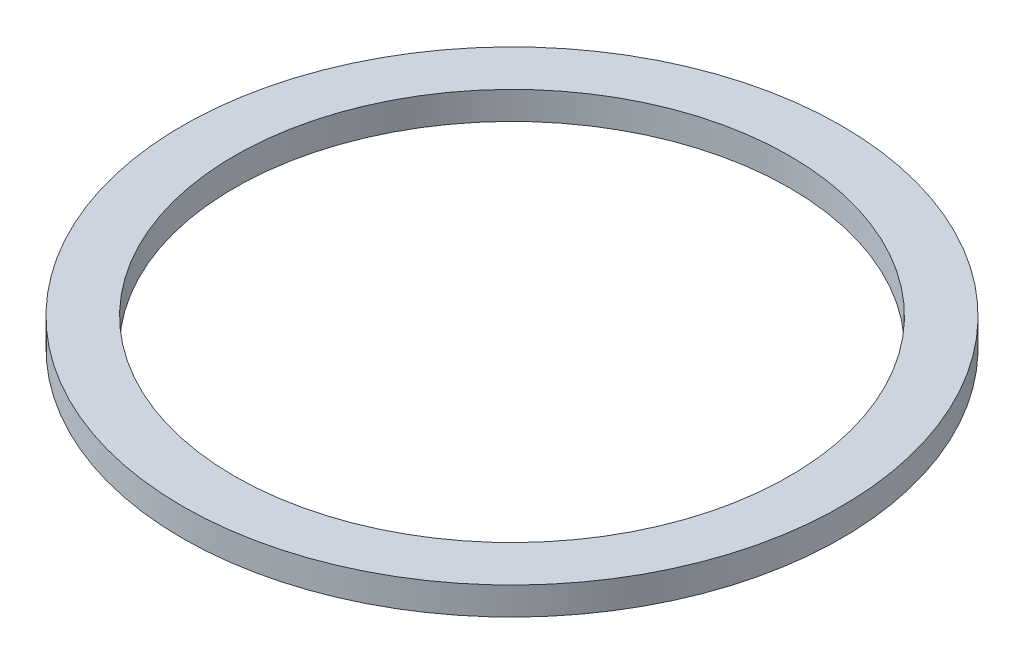
ISO-10303-21;
HEADER;
FILE_DESCRIPTION(('STEP AP214'),'2;1');
FILE_NAME('part.step','',(''),(''),'','','');
FILE_SCHEMA(('AUTOMOTIVE_DESIGN { 1 0 10303 214 1 1 1 1 }'));
ENDSEC;
DATA;
#1=APPLICATION_CONTEXT('core data for automotive mechanical design processes');
#2=APPLICATION_PROTOCOL_DEFINITION('international standard','automotive_design',2000,#1);
#3=PRODUCT_CONTEXT('',#1,'mechanical');
#4=PRODUCT('Part','Part','',(#3));
#5=PRODUCT_RELATED_PRODUCT_CATEGORY('part','',(#4));
#6=PRODUCT_DEFINITION_FORMATION('','',#4);
#7=PRODUCT_DEFINITION_CONTEXT('part definition',#1,'design');
#8=PRODUCT_DEFINITION('design','',#6,#7);
#9=PRODUCT_DEFINITION_SHAPE('','',#8);
#10=(LENGTH_UNIT() NAMED_UNIT(*) SI_UNIT(.MILLI.,.METRE.));
#11=(NAMED_UNIT(*) PLANE_ANGLE_UNIT() SI_UNIT($,.RADIAN.));
#12=(NAMED_UNIT(*) SI_UNIT($,.STERADIAN.) SOLID_ANGLE_UNIT());
#13=UNCERTAINTY_MEASURE_WITH_UNIT(LENGTH_MEASURE(1.E-05),#10,'distance_accuracy_value','');
#14=(GEOMETRIC_REPRESENTATION_CONTEXT(3) GLOBAL_UNCERTAINTY_ASSIGNED_CONTEXT((#13)) GLOBAL_UNIT_ASSIGNED_CONTEXT((#10,
#11,#12)) REPRESENTATION_CONTEXT('',''));
#15=CARTESIAN_POINT('',(0.,0.,0.));
#16=DIRECTION('',(0.,0.,1.));
#17=DIRECTION('',(1.,0.,0.));
#18=AXIS2_PLACEMENT_3D('',#15,#16,#17);
#19=CARTESIAN_POINT('',(0.,4.,0.));
#20=DIRECTION('',(0.,-1.,0.));
#21=DIRECTION('',(0.,0.,-1.));
#22=AXIS2_PLACEMENT_3D('',#19,#20,#21);
#23=CYLINDRICAL_SURFACE('',#22,47.5);
#24=CARTESIAN_POINT('',(0.,4.,0.));
#25=DIRECTION('',(0.,1.,0.));
#26=DIRECTION('',(0.,0.,1.));
#27=AXIS2_PLACEMENT_3D('',#24,#25,#26);
#28=CIRCLE('',#27,47.5);
#29=CARTESIAN_POINT('',(0.,4.,47.5));
#30=VERTEX_POINT('',#29);
#31=EDGE_CURVE('E10',#30,#30,#28,.T.);
#32=ORIENTED_EDGE('',*,*,#31,.F.);
#33=EDGE_LOOP('',(#32));
#34=FACE_BOUND('',#33,.T.);
#35=CARTESIAN_POINT('',(0.,0.,0.));
#36=DIRECTION('',(0.,1.,0.));
#37=DIRECTION('',(0.,0.,1.));
#38=AXIS2_PLACEMENT_3D('',#35,#36,#37);
#39=CIRCLE('',#38,47.5);
#40=CARTESIAN_POINT('',(0.,0.,47.5));
#41=VERTEX_POINT('',#40);
#42=EDGE_CURVE('E37',#41,#41,#39,.T.);
#43=ORIENTED_EDGE('',*,*,#42,.T.);
#44=EDGE_LOOP('',(#43));
#45=FACE_BOUND('',#44,.T.);
#46=ADVANCED_FACE('F40',(#34,#45),#23,.T.);
#47=CARTESIAN_POINT('',(0.,4.,0.));
#48=DIRECTION('',(0.,1.,0.));
#49=DIRECTION('',(0.,0.,1.));
#50=AXIS2_PLACEMENT_3D('',#47,#48,#49);
#51=PLANE('',#50);
#52=CARTESIAN_POINT('',(0.,4.,0.));
#53=DIRECTION('',(0.,1.,0.));
#54=DIRECTION('',(0.,0.,1.));
#55=AXIS2_PLACEMENT_3D('',#52,#53,#54);
#56=CIRCLE('',#55,40.);
#57=CARTESIAN_POINT('',(0.,4.,40.));
#58=VERTEX_POINT('',#57);
#59=EDGE_CURVE('E50',#58,#58,#56,.T.);
#60=ORIENTED_EDGE('',*,*,#59,.F.);
#61=EDGE_LOOP('',(#60));
#62=FACE_BOUND('',#61,.T.);
#63=ORIENTED_EDGE('',*,*,#31,.T.);
#64=EDGE_LOOP('',(#63));
#65=FACE_BOUND('',#64,.T.);
#66=ADVANCED_FACE('F59',(#62,#65),#51,.T.);
#67=CARTESIAN_POINT('',(0.,0.,0.));
#68=DIRECTION('',(0.,1.,0.));
#69=DIRECTION('',(0.,0.,1.));
#70=AXIS2_PLACEMENT_3D('',#67,#68,#69);
#71=PLANE('',#70);
#72=CARTESIAN_POINT('',(0.,0.,0.));
#73=DIRECTION('',(0.,1.,0.));
#74=DIRECTION('',(0.,0.,1.));
#75=AXIS2_PLACEMENT_3D('',#72,#73,#74);
#76=CIRCLE('',#75,40.);
#77=CARTESIAN_POINT('',(0.,0.,40.));
#78=VERTEX_POINT('',#77);
#79=EDGE_CURVE('E47',#78,#78,#76,.T.);
#80=ORIENTED_EDGE('',*,*,#79,.T.);
#81=EDGE_LOOP('',(#80));
#82=FACE_BOUND('',#81,.T.);
#83=ORIENTED_EDGE('',*,*,#42,.F.);
#84=EDGE_LOOP('',(#83));
#85=FACE_BOUND('',#84,.T.);
#86=ADVANCED_FACE('F58',(#82,#85),#71,.F.);
#87=CARTESIAN_POINT('',(0.,4.,0.));
#88=DIRECTION('',(0.,-1.,0.));
#89=DIRECTION('',(0.,0.,-1.));
#90=AXIS2_PLACEMENT_3D('',#87,#88,#89);
#91=CYLINDRICAL_SURFACE('',#90,40.);
#92=ORIENTED_EDGE('',*,*,#59,.T.);
#93=EDGE_LOOP('',(#92));
#94=FACE_BOUND('',#93,.T.);
#95=ORIENTED_EDGE('',*,*,#79,.F.);
#96=EDGE_LOOP('',(#95));
#97=FACE_BOUND('',#96,.T.);
#98=ADVANCED_FACE('F54',(#94,#97),#91,.F.);
#99=CLOSED_SHELL('',(#46,#66,#86,#98));
#100=MANIFOLD_SOLID_BREP('B2',#99);
#101=ADVANCED_BREP_SHAPE_REPRESENTATION('',(#18,#100),#14);
#102=SHAPE_DEFINITION_REPRESENTATION(#9,#101);
ENDSEC;
END-ISO-10303-21;
